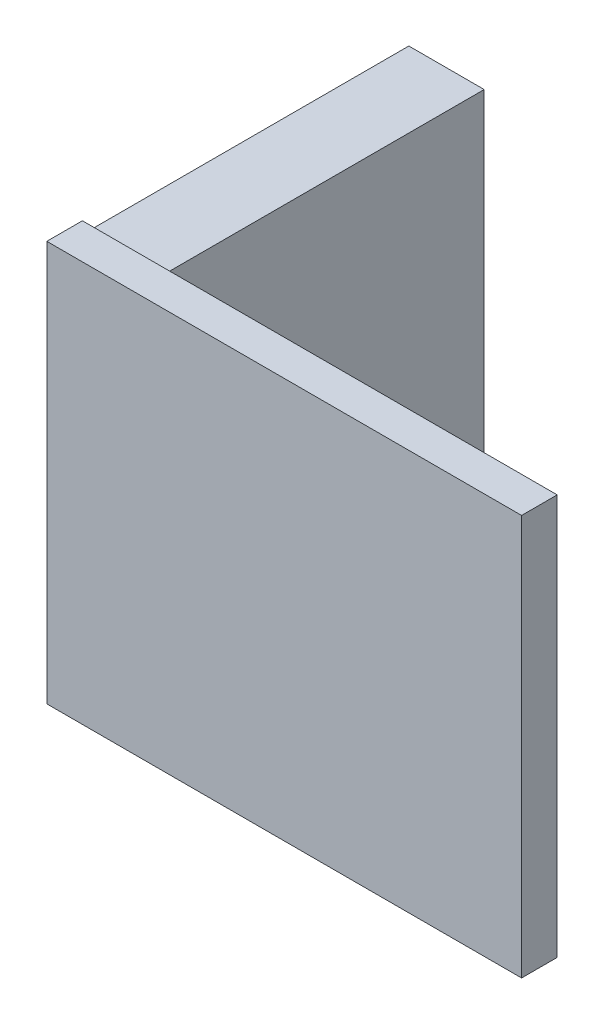
ISO-10303-21;
HEADER;
FILE_DESCRIPTION(('STEP AP214'),'2;1');
FILE_NAME('part.step','',(''),(''),'','','');
FILE_SCHEMA(('AUTOMOTIVE_DESIGN { 1 0 10303 214 1 1 1 1 }'));
ENDSEC;
DATA;
#1=APPLICATION_CONTEXT('core data for automotive mechanical design processes');
#2=APPLICATION_PROTOCOL_DEFINITION('international standard','automotive_design',2000,#1);
#3=PRODUCT_CONTEXT('',#1,'mechanical');
#4=PRODUCT('Part','Part','',(#3));
#5=PRODUCT_RELATED_PRODUCT_CATEGORY('part','',(#4));
#6=PRODUCT_DEFINITION_FORMATION('','',#4);
#7=PRODUCT_DEFINITION_CONTEXT('part definition',#1,'design');
#8=PRODUCT_DEFINITION('design','',#6,#7);
#9=PRODUCT_DEFINITION_SHAPE('','',#8);
#10=(LENGTH_UNIT() NAMED_UNIT(*) SI_UNIT(.MILLI.,.METRE.));
#11=(NAMED_UNIT(*) PLANE_ANGLE_UNIT() SI_UNIT($,.RADIAN.));
#12=(NAMED_UNIT(*) SI_UNIT($,.STERADIAN.) SOLID_ANGLE_UNIT());
#13=UNCERTAINTY_MEASURE_WITH_UNIT(LENGTH_MEASURE(1.E-05),#10,'distance_accuracy_value','');
#14=(GEOMETRIC_REPRESENTATION_CONTEXT(3) GLOBAL_UNCERTAINTY_ASSIGNED_CONTEXT((#13)) GLOBAL_UNIT_ASSIGNED_CONTEXT((#10,
#11,#12)) REPRESENTATION_CONTEXT('',''));
#15=CARTESIAN_POINT('',(0.,0.,0.));
#16=DIRECTION('',(0.,0.,1.));
#17=DIRECTION('',(1.,0.,0.));
#18=AXIS2_PLACEMENT_3D('',#15,#16,#17);
#19=CARTESIAN_POINT('',(-63.881130302261,39.751082042164,11.));
#20=DIRECTION('',(-1.,0.,0.));
#21=DIRECTION('',(0.,-1.,0.));
#22=AXIS2_PLACEMENT_3D('',#19,#20,#21);
#23=PLANE('',#22);
#24=DIRECTION('',(0.,1.,0.));
#25=VECTOR('',#24,1.);
#26=CARTESIAN_POINT('',(-63.881130302261,39.751082042164,0.));
#27=LINE('',#26,#25);
#28=CARTESIAN_POINT('',(-63.881130302261,39.751082042164,0.));
#29=VERTEX_POINT('',#28);
#30=CARTESIAN_POINT('',(-63.881130302261,52.451082042164,0.));
#31=VERTEX_POINT('',#30);
#32=EDGE_CURVE('E131',#29,#31,#27,.T.);
#33=ORIENTED_EDGE('',*,*,#32,.T.);
#34=DIRECTION('',(0.,0.,-1.));
#35=VECTOR('',#34,1.);
#36=CARTESIAN_POINT('',(-63.881130302261,52.451082042164,11.));
#37=LINE('',#36,#35);
#38=CARTESIAN_POINT('',(-63.881130302261,52.451082042164,11.));
#39=VERTEX_POINT('',#38);
#40=EDGE_CURVE('E11',#39,#31,#37,.T.);
#41=ORIENTED_EDGE('',*,*,#40,.F.);
#42=DIRECTION('',(0.,1.,0.));
#43=VECTOR('',#42,1.);
#44=CARTESIAN_POINT('',(-63.881130302261,39.751082042164,11.));
#45=LINE('',#44,#43);
#46=CARTESIAN_POINT('',(-63.881130302261,39.751082042164,11.));
#47=VERTEX_POINT('',#46);
#48=EDGE_CURVE('E140',#47,#39,#45,.T.);
#49=ORIENTED_EDGE('',*,*,#48,.F.);
#50=DIRECTION('',(0.,0.,-1.));
#51=VECTOR('',#50,1.);
#52=CARTESIAN_POINT('',(-63.881130302261,39.751082042164,11.));
#53=LINE('',#52,#51);
#54=EDGE_CURVE('E146',#47,#29,#53,.T.);
#55=ORIENTED_EDGE('',*,*,#54,.T.);
#56=EDGE_LOOP('',(#33,#41,#49,#55));
#57=FACE_BOUND('',#56,.T.);
#58=ADVANCED_FACE('F35',(#57),#23,.F.);
#59=CARTESIAN_POINT('',(-63.881130302261,52.451082042164,11.));
#60=DIRECTION('',(0.,-1.,0.));
#61=DIRECTION('',(0.,0.,-1.));
#62=AXIS2_PLACEMENT_3D('',#59,#60,#61);
#63=PLANE('',#62);
#64=DIRECTION('',(-1.,0.,0.));
#65=VECTOR('',#64,1.);
#66=CARTESIAN_POINT('',(-63.881130302261,52.451082042164,0.));
#67=LINE('',#66,#65);
#68=CARTESIAN_POINT('',(-66.421130302261,52.451082042164,0.));
#69=VERTEX_POINT('',#68);
#70=EDGE_CURVE('E134',#31,#69,#67,.T.);
#71=ORIENTED_EDGE('',*,*,#70,.T.);
#72=DIRECTION('',(0.,0.,-1.));
#73=VECTOR('',#72,1.);
#74=CARTESIAN_POINT('',(-66.421130302261,52.451082042164,11.));
#75=LINE('',#74,#73);
#76=CARTESIAN_POINT('',(-66.421130302261,52.451082042164,11.));
#77=VERTEX_POINT('',#76);
#78=EDGE_CURVE('E43',#77,#69,#75,.T.);
#79=ORIENTED_EDGE('',*,*,#78,.F.);
#80=DIRECTION('',(-1.,0.,0.));
#81=VECTOR('',#80,1.);
#82=CARTESIAN_POINT('',(-63.881130302261,52.451082042164,11.));
#83=LINE('',#82,#81);
#84=EDGE_CURVE('E77',#39,#77,#83,.T.);
#85=ORIENTED_EDGE('',*,*,#84,.F.);
#86=ORIENTED_EDGE('',*,*,#40,.T.);
#87=EDGE_LOOP('',(#71,#79,#85,#86));
#88=FACE_BOUND('',#87,.T.);
#89=ADVANCED_FACE('F189',(#88),#63,.F.);
#90=CARTESIAN_POINT('',(-66.421130302261,39.751082042164,11.));
#91=DIRECTION('',(1.,0.,0.));
#92=DIRECTION('',(0.,0.,-1.));
#93=AXIS2_PLACEMENT_3D('',#90,#91,#92);
#94=PLANE('',#93);
#95=DIRECTION('',(0.,-1.,0.));
#96=VECTOR('',#95,1.);
#97=CARTESIAN_POINT('',(-66.421130302261,39.751082042164,0.));
#98=LINE('',#97,#96);
#99=CARTESIAN_POINT('',(-66.421130302261,39.751082042164,0.));
#100=VERTEX_POINT('',#99);
#101=EDGE_CURVE('E67',#69,#100,#98,.T.);
#102=ORIENTED_EDGE('',*,*,#101,.T.);
#103=DIRECTION('',(0.,0.,-1.));
#104=VECTOR('',#103,1.);
#105=CARTESIAN_POINT('',(-66.421130302261,39.751082042164,11.));
#106=LINE('',#105,#104);
#107=CARTESIAN_POINT('',(-66.421130302261,39.751082042164,11.));
#108=VERTEX_POINT('',#107);
#109=EDGE_CURVE('E51',#108,#100,#106,.T.);
#110=ORIENTED_EDGE('',*,*,#109,.F.);
#111=DIRECTION('',(0.,-1.,0.));
#112=VECTOR('',#111,1.);
#113=CARTESIAN_POINT('',(-66.421130302261,52.851082042164,11.));
#114=LINE('',#113,#112);
#115=CARTESIAN_POINT('',(-66.421130302261,39.351082042164,11.));
#116=VERTEX_POINT('',#115);
#117=EDGE_CURVE('E129',#108,#116,#114,.T.);
#118=ORIENTED_EDGE('',*,*,#117,.T.);
#119=DIRECTION('',(0.,0.,-1.));
#120=VECTOR('',#119,1.);
#121=CARTESIAN_POINT('',(-66.421130302261,39.351082042164,12.2));
#122=LINE('',#121,#120);
#123=CARTESIAN_POINT('',(-66.421130302261,39.351082042164,12.2));
#124=VERTEX_POINT('',#123);
#125=EDGE_CURVE('E111',#124,#116,#122,.T.);
#126=ORIENTED_EDGE('',*,*,#125,.F.);
#127=DIRECTION('',(0.,-1.,0.));
#128=VECTOR('',#127,1.);
#129=CARTESIAN_POINT('',(-66.421130302261,52.851082042164,12.2));
#130=LINE('',#129,#128);
#131=CARTESIAN_POINT('',(-66.421130302261,52.851082042164,12.2));
#132=VERTEX_POINT('',#131);
#133=EDGE_CURVE('E117',#132,#124,#130,.T.);
#134=ORIENTED_EDGE('',*,*,#133,.F.);
#135=DIRECTION('',(0.,0.,-1.));
#136=VECTOR('',#135,1.);
#137=CARTESIAN_POINT('',(-66.421130302261,52.851082042164,12.2));
#138=LINE('',#137,#136);
#139=CARTESIAN_POINT('',(-66.421130302261,52.851082042164,11.));
#140=VERTEX_POINT('',#139);
#141=EDGE_CURVE('E172',#132,#140,#138,.T.);
#142=ORIENTED_EDGE('',*,*,#141,.T.);
#143=EDGE_CURVE('E154',#140,#77,#114,.T.);
#144=ORIENTED_EDGE('',*,*,#143,.T.);
#145=ORIENTED_EDGE('',*,*,#78,.T.);
#146=EDGE_LOOP('',(#102,#110,#118,#126,#134,#142,#144,#145));
#147=FACE_BOUND('',#146,.T.);
#148=ADVANCED_FACE('F127',(#147),#94,.F.);
#149=CARTESIAN_POINT('',(-63.881130302261,39.751082042164,11.));
#150=DIRECTION('',(0.,1.,0.));
#151=DIRECTION('',(0.,0.,1.));
#152=AXIS2_PLACEMENT_3D('',#149,#150,#151);
#153=PLANE('',#152);
#154=DIRECTION('',(1.,0.,0.));
#155=VECTOR('',#154,1.);
#156=CARTESIAN_POINT('',(-63.881130302261,39.751082042164,0.));
#157=LINE('',#156,#155);
#158=EDGE_CURVE('E72',#100,#29,#157,.T.);
#159=ORIENTED_EDGE('',*,*,#158,.T.);
#160=ORIENTED_EDGE('',*,*,#54,.F.);
#161=DIRECTION('',(1.,0.,0.));
#162=VECTOR('',#161,1.);
#163=CARTESIAN_POINT('',(-63.881130302261,39.751082042164,11.));
#164=LINE('',#163,#162);
#165=EDGE_CURVE('E144',#108,#47,#164,.T.);
#166=ORIENTED_EDGE('',*,*,#165,.F.);
#167=ORIENTED_EDGE('',*,*,#109,.T.);
#168=EDGE_LOOP('',(#159,#160,#166,#167));
#169=FACE_BOUND('',#168,.T.);
#170=ADVANCED_FACE('F159',(#169),#153,.F.);
#171=CARTESIAN_POINT('',(0.,0.,0.));
#172=DIRECTION('',(0.,0.,1.));
#173=DIRECTION('',(1.,0.,0.));
#174=AXIS2_PLACEMENT_3D('',#171,#172,#173);
#175=PLANE('',#174);
#176=ORIENTED_EDGE('',*,*,#32,.F.);
#177=ORIENTED_EDGE('',*,*,#158,.F.);
#178=ORIENTED_EDGE('',*,*,#101,.F.);
#179=ORIENTED_EDGE('',*,*,#70,.F.);
#180=EDGE_LOOP('',(#176,#177,#178,#179));
#181=FACE_BOUND('',#180,.T.);
#182=ADVANCED_FACE('F157',(#181),#175,.F.);
#183=CARTESIAN_POINT('',(0.,0.,11.));
#184=DIRECTION('',(0.,0.,1.));
#185=DIRECTION('',(1.,0.,0.));
#186=AXIS2_PLACEMENT_3D('',#183,#184,#185);
#187=PLANE('',#186);
#188=ORIENTED_EDGE('',*,*,#48,.T.);
#189=ORIENTED_EDGE('',*,*,#84,.T.);
#190=ORIENTED_EDGE('',*,*,#143,.F.);
#191=DIRECTION('',(-1.,0.,0.));
#192=VECTOR('',#191,1.);
#193=CARTESIAN_POINT('',(-66.421130302261,52.851082042164,11.));
#194=LINE('',#193,#192);
#195=CARTESIAN_POINT('',(-50.421130302261,52.851082042164,11.));
#196=VERTEX_POINT('',#195);
#197=EDGE_CURVE('E125',#196,#140,#194,.T.);
#198=ORIENTED_EDGE('',*,*,#197,.F.);
#199=DIRECTION('',(0.,1.,0.));
#200=VECTOR('',#199,1.);
#201=CARTESIAN_POINT('',(-50.421130302261,52.851082042164,11.));
#202=LINE('',#201,#200);
#203=CARTESIAN_POINT('',(-50.421130302261,39.351082042164,11.));
#204=VERTEX_POINT('',#203);
#205=EDGE_CURVE('E169',#204,#196,#202,.T.);
#206=ORIENTED_EDGE('',*,*,#205,.F.);
#207=DIRECTION('',(1.,0.,0.));
#208=VECTOR('',#207,1.);
#209=CARTESIAN_POINT('',(-66.421130302261,39.351082042164,11.));
#210=LINE('',#209,#208);
#211=EDGE_CURVE('E163',#116,#204,#210,.T.);
#212=ORIENTED_EDGE('',*,*,#211,.F.);
#213=ORIENTED_EDGE('',*,*,#117,.F.);
#214=ORIENTED_EDGE('',*,*,#165,.T.);
#215=EDGE_LOOP('',(#188,#189,#190,#198,#206,#212,#213,#214));
#216=FACE_BOUND('',#215,.T.);
#217=ADVANCED_FACE('F161',(#216),#187,.F.);
#218=CARTESIAN_POINT('',(-66.421130302261,39.351082042164,12.2));
#219=DIRECTION('',(0.,1.,0.));
#220=DIRECTION('',(0.,0.,1.));
#221=AXIS2_PLACEMENT_3D('',#218,#219,#220);
#222=PLANE('',#221);
#223=ORIENTED_EDGE('',*,*,#211,.T.);
#224=DIRECTION('',(0.,0.,-1.));
#225=VECTOR('',#224,1.);
#226=CARTESIAN_POINT('',(-50.421130302261,39.351082042164,12.2));
#227=LINE('',#226,#225);
#228=CARTESIAN_POINT('',(-50.421130302261,39.351082042164,12.2));
#229=VERTEX_POINT('',#228);
#230=EDGE_CURVE('E113',#229,#204,#227,.T.);
#231=ORIENTED_EDGE('',*,*,#230,.F.);
#232=DIRECTION('',(1.,0.,0.));
#233=VECTOR('',#232,1.);
#234=CARTESIAN_POINT('',(-66.421130302261,39.351082042164,12.2));
#235=LINE('',#234,#233);
#236=EDGE_CURVE('E107',#124,#229,#235,.T.);
#237=ORIENTED_EDGE('',*,*,#236,.F.);
#238=ORIENTED_EDGE('',*,*,#125,.T.);
#239=EDGE_LOOP('',(#223,#231,#237,#238));
#240=FACE_BOUND('',#239,.T.);
#241=ADVANCED_FACE('F109',(#240),#222,.F.);
#242=CARTESIAN_POINT('',(-50.421130302261,52.851082042164,12.2));
#243=DIRECTION('',(-1.,0.,0.));
#244=DIRECTION('',(0.,0.,1.));
#245=AXIS2_PLACEMENT_3D('',#242,#243,#244);
#246=PLANE('',#245);
#247=ORIENTED_EDGE('',*,*,#205,.T.);
#248=DIRECTION('',(0.,0.,-1.));
#249=VECTOR('',#248,1.);
#250=CARTESIAN_POINT('',(-50.421130302261,52.851082042164,12.2));
#251=LINE('',#250,#249);
#252=CARTESIAN_POINT('',(-50.421130302261,52.851082042164,12.2));
#253=VERTEX_POINT('',#252);
#254=EDGE_CURVE('E136',#253,#196,#251,.T.);
#255=ORIENTED_EDGE('',*,*,#254,.F.);
#256=DIRECTION('',(0.,1.,0.));
#257=VECTOR('',#256,1.);
#258=CARTESIAN_POINT('',(-50.421130302261,52.851082042164,12.2));
#259=LINE('',#258,#257);
#260=EDGE_CURVE('E116',#229,#253,#259,.T.);
#261=ORIENTED_EDGE('',*,*,#260,.F.);
#262=ORIENTED_EDGE('',*,*,#230,.T.);
#263=EDGE_LOOP('',(#247,#255,#261,#262));
#264=FACE_BOUND('',#263,.T.);
#265=ADVANCED_FACE('F179',(#264),#246,.F.);
#266=CARTESIAN_POINT('',(-66.421130302261,52.851082042164,12.2));
#267=DIRECTION('',(0.,-1.,0.));
#268=DIRECTION('',(0.,0.,-1.));
#269=AXIS2_PLACEMENT_3D('',#266,#267,#268);
#270=PLANE('',#269);
#271=ORIENTED_EDGE('',*,*,#197,.T.);
#272=ORIENTED_EDGE('',*,*,#141,.F.);
#273=DIRECTION('',(-1.,0.,0.));
#274=VECTOR('',#273,1.);
#275=CARTESIAN_POINT('',(-66.421130302261,52.851082042164,12.2));
#276=LINE('',#275,#274);
#277=EDGE_CURVE('E122',#253,#132,#276,.T.);
#278=ORIENTED_EDGE('',*,*,#277,.F.);
#279=ORIENTED_EDGE('',*,*,#254,.T.);
#280=EDGE_LOOP('',(#271,#272,#278,#279));
#281=FACE_BOUND('',#280,.T.);
#282=ADVANCED_FACE('F177',(#281),#270,.F.);
#283=CARTESIAN_POINT('',(0.,0.,12.2));
#284=DIRECTION('',(0.,0.,1.));
#285=DIRECTION('',(1.,0.,0.));
#286=AXIS2_PLACEMENT_3D('',#283,#284,#285);
#287=PLANE('',#286);
#288=ORIENTED_EDGE('',*,*,#133,.T.);
#289=ORIENTED_EDGE('',*,*,#236,.T.);
#290=ORIENTED_EDGE('',*,*,#260,.T.);
#291=ORIENTED_EDGE('',*,*,#277,.T.);
#292=EDGE_LOOP('',(#288,#289,#290,#291));
#293=FACE_BOUND('',#292,.T.);
#294=ADVANCED_FACE('F120',(#293),#287,.T.);
#295=CLOSED_SHELL('',(#58,#89,#148,#170,#182,#217,#241,#265,#282,#294));
#296=MANIFOLD_SOLID_BREP('B2',#295);
#297=ADVANCED_BREP_SHAPE_REPRESENTATION('',(#18,#296),#14);
#298=SHAPE_DEFINITION_REPRESENTATION(#9,#297);
ENDSEC;
END-ISO-10303-21;
